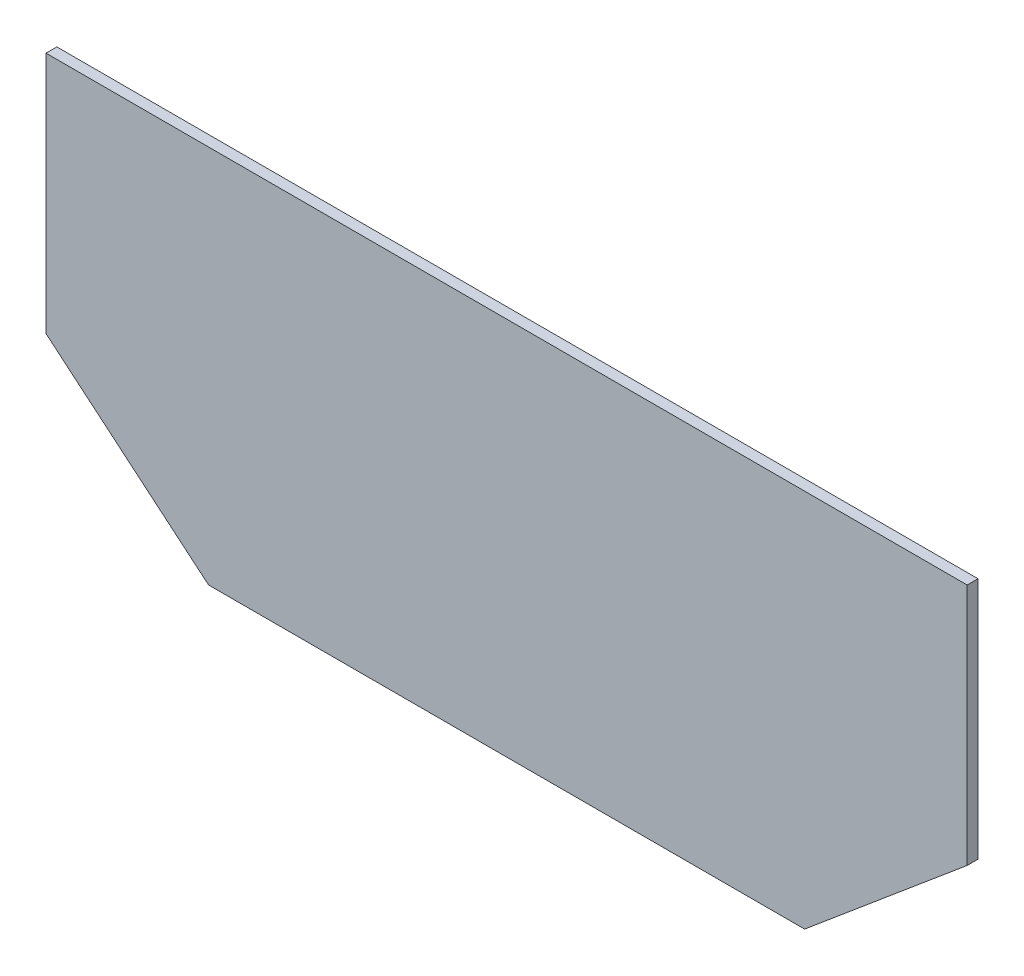
ISO-10303-21;
HEADER;
FILE_DESCRIPTION(('STEP AP214'),'2;1');
FILE_NAME('part.step','',(''),(''),'','','');
FILE_SCHEMA(('AUTOMOTIVE_DESIGN { 1 0 10303 214 1 1 1 1 }'));
ENDSEC;
DATA;
#1=APPLICATION_CONTEXT('core data for automotive mechanical design processes');
#2=APPLICATION_PROTOCOL_DEFINITION('international standard','automotive_design',2000,#1);
#3=PRODUCT_CONTEXT('',#1,'mechanical');
#4=PRODUCT('Part','Part','',(#3));
#5=PRODUCT_RELATED_PRODUCT_CATEGORY('part','',(#4));
#6=PRODUCT_DEFINITION_FORMATION('','',#4);
#7=PRODUCT_DEFINITION_CONTEXT('part definition',#1,'design');
#8=PRODUCT_DEFINITION('design','',#6,#7);
#9=PRODUCT_DEFINITION_SHAPE('','',#8);
#10=(LENGTH_UNIT() NAMED_UNIT(*) SI_UNIT(.MILLI.,.METRE.));
#11=(NAMED_UNIT(*) PLANE_ANGLE_UNIT() SI_UNIT($,.RADIAN.));
#12=(NAMED_UNIT(*) SI_UNIT($,.STERADIAN.) SOLID_ANGLE_UNIT());
#13=UNCERTAINTY_MEASURE_WITH_UNIT(LENGTH_MEASURE(1.E-05),#10,'distance_accuracy_value','');
#14=(GEOMETRIC_REPRESENTATION_CONTEXT(3) GLOBAL_UNCERTAINTY_ASSIGNED_CONTEXT((#13)) GLOBAL_UNIT_ASSIGNED_CONTEXT((#10,
#11,#12)) REPRESENTATION_CONTEXT('',''));
#15=CARTESIAN_POINT('',(0.,0.,0.));
#16=DIRECTION('',(0.,0.,1.));
#17=DIRECTION('',(1.,0.,0.));
#18=AXIS2_PLACEMENT_3D('',#15,#16,#17);
#19=CARTESIAN_POINT('',(-55.,0.,2.));
#20=DIRECTION('',(0.64278760968654,0.766044443118977,0.));
#21=DIRECTION('',(-0.766044443118977,0.64278760968654,0.));
#22=AXIS2_PLACEMENT_3D('',#19,#20,#21);
#23=PLANE('',#22);
#24=DIRECTION('',(0.766044443118977,-0.64278760968654,0.));
#25=VECTOR('',#24,1.);
#26=CARTESIAN_POINT('',(-55.,0.,0.));
#27=LINE('',#26,#25);
#28=CARTESIAN_POINT('',(-85.,25.1729889353185,0.));
#29=VERTEX_POINT('',#28);
#30=CARTESIAN_POINT('',(-55.,0.,0.));
#31=VERTEX_POINT('',#30);
#32=EDGE_CURVE('E116',#29,#31,#27,.T.);
#33=ORIENTED_EDGE('',*,*,#32,.T.);
#34=DIRECTION('',(0.,0.,-1.));
#35=VECTOR('',#34,1.);
#36=CARTESIAN_POINT('',(-55.,0.,2.));
#37=LINE('',#36,#35);
#38=CARTESIAN_POINT('',(-55.,0.,2.));
#39=VERTEX_POINT('',#38);
#40=EDGE_CURVE('E11',#39,#31,#37,.T.);
#41=ORIENTED_EDGE('',*,*,#40,.F.);
#42=DIRECTION('',(0.766044443118977,-0.64278760968654,0.));
#43=VECTOR('',#42,1.);
#44=CARTESIAN_POINT('',(-55.,0.,2.));
#45=LINE('',#44,#43);
#46=CARTESIAN_POINT('',(-85.,25.1729889353185,2.));
#47=VERTEX_POINT('',#46);
#48=EDGE_CURVE('E126',#47,#39,#45,.T.);
#49=ORIENTED_EDGE('',*,*,#48,.F.);
#50=DIRECTION('',(0.,0.,-1.));
#51=VECTOR('',#50,1.);
#52=CARTESIAN_POINT('',(-85.,25.1729889353185,2.));
#53=LINE('',#52,#51);
#54=EDGE_CURVE('E112',#47,#29,#53,.T.);
#55=ORIENTED_EDGE('',*,*,#54,.T.);
#56=EDGE_LOOP('',(#33,#41,#49,#55));
#57=FACE_BOUND('',#56,.T.);
#58=ADVANCED_FACE('F32',(#57),#23,.F.);
#59=CARTESIAN_POINT('',(55.,0.,2.));
#60=DIRECTION('',(0.,1.,0.));
#61=DIRECTION('',(0.,0.,1.));
#62=AXIS2_PLACEMENT_3D('',#59,#60,#61);
#63=PLANE('',#62);
#64=DIRECTION('',(1.,0.,0.));
#65=VECTOR('',#64,1.);
#66=CARTESIAN_POINT('',(55.,0.,0.));
#67=LINE('',#66,#65);
#68=CARTESIAN_POINT('',(55.,0.,0.));
#69=VERTEX_POINT('',#68);
#70=EDGE_CURVE('E119',#31,#69,#67,.T.);
#71=ORIENTED_EDGE('',*,*,#70,.T.);
#72=DIRECTION('',(0.,0.,-1.));
#73=VECTOR('',#72,1.);
#74=CARTESIAN_POINT('',(55.,0.,2.));
#75=LINE('',#74,#73);
#76=CARTESIAN_POINT('',(55.,0.,2.));
#77=VERTEX_POINT('',#76);
#78=EDGE_CURVE('E40',#77,#69,#75,.T.);
#79=ORIENTED_EDGE('',*,*,#78,.F.);
#80=DIRECTION('',(1.,0.,0.));
#81=VECTOR('',#80,1.);
#82=CARTESIAN_POINT('',(55.,0.,2.));
#83=LINE('',#82,#81);
#84=EDGE_CURVE('E85',#39,#77,#83,.T.);
#85=ORIENTED_EDGE('',*,*,#84,.F.);
#86=ORIENTED_EDGE('',*,*,#40,.T.);
#87=EDGE_LOOP('',(#71,#79,#85,#86));
#88=FACE_BOUND('',#87,.T.);
#89=ADVANCED_FACE('F150',(#88),#63,.F.);
#90=CARTESIAN_POINT('',(55.,0.,2.));
#91=DIRECTION('',(-0.64278760968654,0.766044443118977,0.));
#92=DIRECTION('',(-0.766044443118977,-0.64278760968654,0.));
#93=AXIS2_PLACEMENT_3D('',#90,#91,#92);
#94=PLANE('',#93);
#95=DIRECTION('',(0.766044443118977,0.64278760968654,0.));
#96=VECTOR('',#95,1.);
#97=CARTESIAN_POINT('',(55.,0.,0.));
#98=LINE('',#97,#96);
#99=CARTESIAN_POINT('',(85.,25.1729889353185,0.));
#100=VERTEX_POINT('',#99);
#101=EDGE_CURVE('E121',#69,#100,#98,.T.);
#102=ORIENTED_EDGE('',*,*,#101,.T.);
#103=DIRECTION('',(0.,0.,-1.));
#104=VECTOR('',#103,1.);
#105=CARTESIAN_POINT('',(85.,25.1729889353185,2.));
#106=LINE('',#105,#104);
#107=CARTESIAN_POINT('',(85.,25.1729889353185,2.));
#108=VERTEX_POINT('',#107);
#109=EDGE_CURVE('E107',#108,#100,#106,.T.);
#110=ORIENTED_EDGE('',*,*,#109,.F.);
#111=DIRECTION('',(0.766044443118977,0.64278760968654,0.));
#112=VECTOR('',#111,1.);
#113=CARTESIAN_POINT('',(55.,0.,2.));
#114=LINE('',#113,#112);
#115=EDGE_CURVE('E98',#77,#108,#114,.T.);
#116=ORIENTED_EDGE('',*,*,#115,.F.);
#117=ORIENTED_EDGE('',*,*,#78,.T.);
#118=EDGE_LOOP('',(#102,#110,#116,#117));
#119=FACE_BOUND('',#118,.T.);
#120=ADVANCED_FACE('F132',(#119),#94,.F.);
#121=CARTESIAN_POINT('',(85.,25.1729889353185,2.));
#122=DIRECTION('',(-1.,0.,0.));
#123=DIRECTION('',(0.,0.,1.));
#124=AXIS2_PLACEMENT_3D('',#121,#122,#123);
#125=PLANE('',#124);
#126=DIRECTION('',(0.,1.,0.));
#127=VECTOR('',#126,1.);
#128=CARTESIAN_POINT('',(85.,25.1729889353185,0.));
#129=LINE('',#128,#127);
#130=CARTESIAN_POINT('',(85.,70.,0.));
#131=VERTEX_POINT('',#130);
#132=EDGE_CURVE('E106',#100,#131,#129,.T.);
#133=ORIENTED_EDGE('',*,*,#132,.T.);
#134=DIRECTION('',(0.,0.,-1.));
#135=VECTOR('',#134,1.);
#136=CARTESIAN_POINT('',(85.,70.,2.));
#137=LINE('',#136,#135);
#138=CARTESIAN_POINT('',(85.,70.,2.));
#139=VERTEX_POINT('',#138);
#140=EDGE_CURVE('E103',#139,#131,#137,.T.);
#141=ORIENTED_EDGE('',*,*,#140,.F.);
#142=DIRECTION('',(0.,1.,0.));
#143=VECTOR('',#142,1.);
#144=CARTESIAN_POINT('',(85.,25.1729889353185,2.));
#145=LINE('',#144,#143);
#146=EDGE_CURVE('E92',#108,#139,#145,.T.);
#147=ORIENTED_EDGE('',*,*,#146,.F.);
#148=ORIENTED_EDGE('',*,*,#109,.T.);
#149=EDGE_LOOP('',(#133,#141,#147,#148));
#150=FACE_BOUND('',#149,.T.);
#151=ADVANCED_FACE('F104',(#150),#125,.F.);
#152=CARTESIAN_POINT('',(-85.,70.,2.));
#153=DIRECTION('',(0.,-1.,0.));
#154=DIRECTION('',(0.,0.,-1.));
#155=AXIS2_PLACEMENT_3D('',#152,#153,#154);
#156=PLANE('',#155);
#157=DIRECTION('',(-1.,0.,0.));
#158=VECTOR('',#157,1.);
#159=CARTESIAN_POINT('',(-85.,70.,0.));
#160=LINE('',#159,#158);
#161=CARTESIAN_POINT('',(-85.,70.,0.));
#162=VERTEX_POINT('',#161);
#163=EDGE_CURVE('E71',#131,#162,#160,.T.);
#164=ORIENTED_EDGE('',*,*,#163,.T.);
#165=DIRECTION('',(0.,0.,-1.));
#166=VECTOR('',#165,1.);
#167=CARTESIAN_POINT('',(-85.,70.,2.));
#168=LINE('',#167,#166);
#169=CARTESIAN_POINT('',(-85.,70.,2.));
#170=VERTEX_POINT('',#169);
#171=EDGE_CURVE('E108',#170,#162,#168,.T.);
#172=ORIENTED_EDGE('',*,*,#171,.F.);
#173=DIRECTION('',(-1.,0.,0.));
#174=VECTOR('',#173,1.);
#175=CARTESIAN_POINT('',(-85.,70.,2.));
#176=LINE('',#175,#174);
#177=EDGE_CURVE('E96',#139,#170,#176,.T.);
#178=ORIENTED_EDGE('',*,*,#177,.F.);
#179=ORIENTED_EDGE('',*,*,#140,.T.);
#180=EDGE_LOOP('',(#164,#172,#178,#179));
#181=FACE_BOUND('',#180,.T.);
#182=ADVANCED_FACE('F110',(#181),#156,.F.);
#183=CARTESIAN_POINT('',(-85.,25.1729889353185,2.));
#184=DIRECTION('',(1.,0.,0.));
#185=DIRECTION('',(0.,0.,-1.));
#186=AXIS2_PLACEMENT_3D('',#183,#184,#185);
#187=PLANE('',#186);
#188=DIRECTION('',(0.,-1.,0.));
#189=VECTOR('',#188,1.);
#190=CARTESIAN_POINT('',(-85.,25.1729889353185,0.));
#191=LINE('',#190,#189);
#192=EDGE_CURVE('E77',#162,#29,#191,.T.);
#193=ORIENTED_EDGE('',*,*,#192,.T.);
#194=ORIENTED_EDGE('',*,*,#54,.F.);
#195=DIRECTION('',(0.,-1.,0.));
#196=VECTOR('',#195,1.);
#197=CARTESIAN_POINT('',(-85.,25.1729889353185,2.));
#198=LINE('',#197,#196);
#199=EDGE_CURVE('E48',#170,#47,#198,.T.);
#200=ORIENTED_EDGE('',*,*,#199,.F.);
#201=ORIENTED_EDGE('',*,*,#171,.T.);
#202=EDGE_LOOP('',(#193,#194,#200,#201));
#203=FACE_BOUND('',#202,.T.);
#204=ADVANCED_FACE('F139',(#203),#187,.F.);
#205=CARTESIAN_POINT('',(0.,0.,2.));
#206=DIRECTION('',(0.,0.,-1.));
#207=DIRECTION('',(-1.,0.,0.));
#208=AXIS2_PLACEMENT_3D('',#205,#206,#207);
#209=PLANE('',#208);
#210=ORIENTED_EDGE('',*,*,#48,.T.);
#211=ORIENTED_EDGE('',*,*,#84,.T.);
#212=ORIENTED_EDGE('',*,*,#115,.T.);
#213=ORIENTED_EDGE('',*,*,#146,.T.);
#214=ORIENTED_EDGE('',*,*,#177,.T.);
#215=ORIENTED_EDGE('',*,*,#199,.T.);
#216=EDGE_LOOP('',(#210,#211,#212,#213,#214,#215));
#217=FACE_BOUND('',#216,.T.);
#218=ADVANCED_FACE('F94',(#217),#209,.F.);
#219=CARTESIAN_POINT('',(0.,0.,0.));
#220=DIRECTION('',(0.,0.,-1.));
#221=DIRECTION('',(-1.,0.,0.));
#222=AXIS2_PLACEMENT_3D('',#219,#220,#221);
#223=PLANE('',#222);
#224=ORIENTED_EDGE('',*,*,#32,.F.);
#225=ORIENTED_EDGE('',*,*,#192,.F.);
#226=ORIENTED_EDGE('',*,*,#163,.F.);
#227=ORIENTED_EDGE('',*,*,#132,.F.);
#228=ORIENTED_EDGE('',*,*,#101,.F.);
#229=ORIENTED_EDGE('',*,*,#70,.F.);
#230=EDGE_LOOP('',(#224,#225,#226,#227,#228,#229));
#231=FACE_BOUND('',#230,.T.);
#232=ADVANCED_FACE('F135',(#231),#223,.T.);
#233=CLOSED_SHELL('',(#58,#89,#120,#151,#182,#204,#218,#232));
#234=MANIFOLD_SOLID_BREP('B2',#233);
#235=ADVANCED_BREP_SHAPE_REPRESENTATION('',(#18,#234),#14);
#236=SHAPE_DEFINITION_REPRESENTATION(#9,#235);
ENDSEC;
END-ISO-10303-21;
